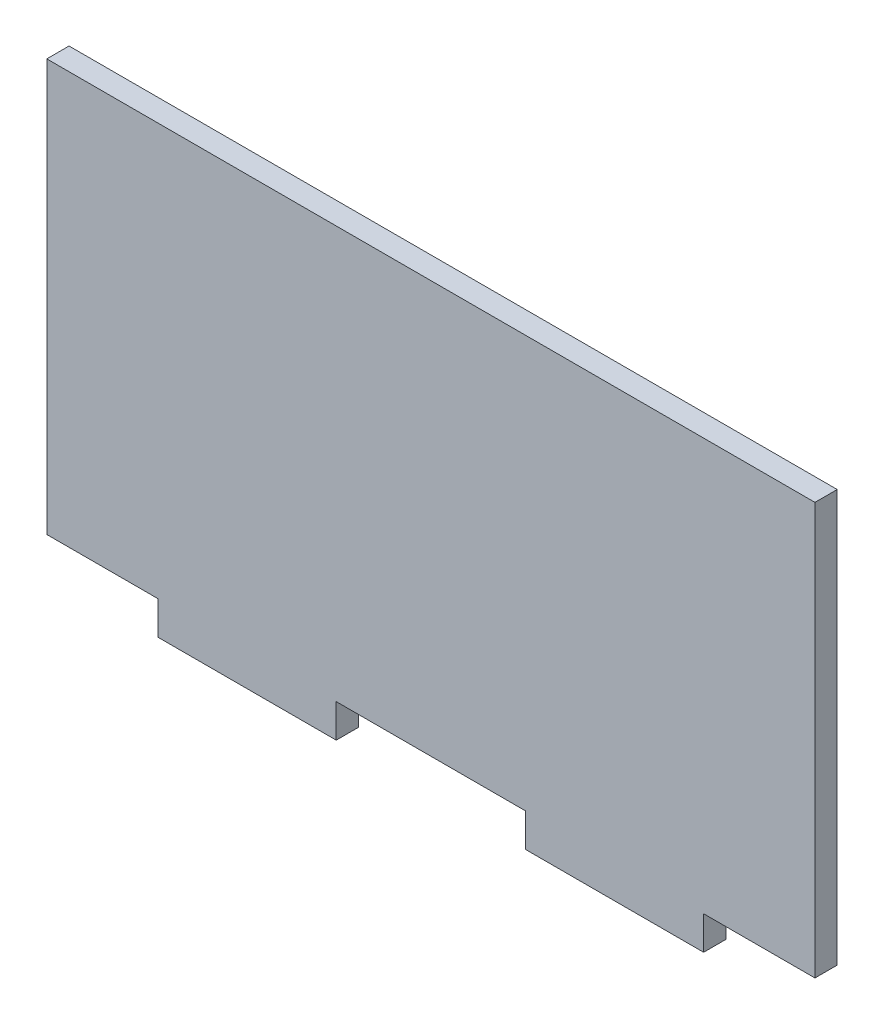
ISO-10303-21;
HEADER;
FILE_DESCRIPTION(('STEP AP214'),'2;1');
FILE_NAME('part.step','',(''),(''),'','','');
FILE_SCHEMA(('AUTOMOTIVE_DESIGN { 1 0 10303 214 1 1 1 1 }'));
ENDSEC;
DATA;
#1=APPLICATION_CONTEXT('core data for automotive mechanical design processes');
#2=APPLICATION_PROTOCOL_DEFINITION('international standard','automotive_design',2000,#1);
#3=PRODUCT_CONTEXT('',#1,'mechanical');
#4=PRODUCT('Part','Part','',(#3));
#5=PRODUCT_RELATED_PRODUCT_CATEGORY('part','',(#4));
#6=PRODUCT_DEFINITION_FORMATION('','',#4);
#7=PRODUCT_DEFINITION_CONTEXT('part definition',#1,'design');
#8=PRODUCT_DEFINITION('design','',#6,#7);
#9=PRODUCT_DEFINITION_SHAPE('','',#8);
#10=(LENGTH_UNIT() NAMED_UNIT(*) SI_UNIT(.MILLI.,.METRE.));
#11=(NAMED_UNIT(*) PLANE_ANGLE_UNIT() SI_UNIT($,.RADIAN.));
#12=(NAMED_UNIT(*) SI_UNIT($,.STERADIAN.) SOLID_ANGLE_UNIT());
#13=UNCERTAINTY_MEASURE_WITH_UNIT(LENGTH_MEASURE(1.E-05),#10,'distance_accuracy_value','');
#14=(GEOMETRIC_REPRESENTATION_CONTEXT(3) GLOBAL_UNCERTAINTY_ASSIGNED_CONTEXT((#13)) GLOBAL_UNIT_ASSIGNED_CONTEXT((#10,
#11,#12)) REPRESENTATION_CONTEXT('',''));
#15=CARTESIAN_POINT('',(0.,0.,0.));
#16=DIRECTION('',(0.,0.,1.));
#17=DIRECTION('',(1.,0.,0.));
#18=AXIS2_PLACEMENT_3D('',#15,#16,#17);
#19=CARTESIAN_POINT('',(0.,-17.,2.));
#20=DIRECTION('',(0.,-1.,0.));
#21=DIRECTION('',(1.,0.,0.));
#22=AXIS2_PLACEMENT_3D('',#19,#20,#21);
#23=PLANE('',#22);
#24=DIRECTION('',(-1.,0.,0.));
#25=VECTOR('',#24,1.);
#26=CARTESIAN_POINT('',(0.,-17.,0.));
#27=LINE('',#26,#25);
#28=CARTESIAN_POINT('',(34.5,-17.,0.));
#29=VERTEX_POINT('',#28);
#30=CARTESIAN_POINT('',(24.5,-17.,0.));
#31=VERTEX_POINT('',#30);
#32=EDGE_CURVE('E169',#29,#31,#27,.T.);
#33=ORIENTED_EDGE('',*,*,#32,.F.);
#34=DIRECTION('',(0.,0.,-1.));
#35=VECTOR('',#34,1.);
#36=CARTESIAN_POINT('',(34.5,-17.,2.));
#37=LINE('',#36,#35);
#38=CARTESIAN_POINT('',(34.5,-17.,2.));
#39=VERTEX_POINT('',#38);
#40=EDGE_CURVE('E11',#39,#29,#37,.T.);
#41=ORIENTED_EDGE('',*,*,#40,.F.);
#42=DIRECTION('',(-1.,0.,0.));
#43=VECTOR('',#42,1.);
#44=CARTESIAN_POINT('',(0.,-17.,2.));
#45=LINE('',#44,#43);
#46=CARTESIAN_POINT('',(24.5,-17.,2.));
#47=VERTEX_POINT('',#46);
#48=EDGE_CURVE('E163',#39,#47,#45,.T.);
#49=ORIENTED_EDGE('',*,*,#48,.T.);
#50=DIRECTION('',(0.,0.,-1.));
#51=VECTOR('',#50,1.);
#52=CARTESIAN_POINT('',(24.5,-17.,2.));
#53=LINE('',#52,#51);
#54=EDGE_CURVE('E105',#47,#31,#53,.T.);
#55=ORIENTED_EDGE('',*,*,#54,.T.);
#56=EDGE_LOOP('',(#33,#41,#49,#55));
#57=FACE_BOUND('',#56,.T.);
#58=ADVANCED_FACE('F41',(#57),#23,.T.);
#59=CARTESIAN_POINT('',(34.5,0.,2.));
#60=DIRECTION('',(-1.,0.,0.));
#61=DIRECTION('',(0.,0.,1.));
#62=AXIS2_PLACEMENT_3D('',#59,#60,#61);
#63=PLANE('',#62);
#64=DIRECTION('',(0.,1.,0.));
#65=VECTOR('',#64,1.);
#66=CARTESIAN_POINT('',(34.5,0.,0.));
#67=LINE('',#66,#65);
#68=CARTESIAN_POINT('',(34.5,20.,0.));
#69=VERTEX_POINT('',#68);
#70=EDGE_CURVE('E173',#29,#69,#67,.T.);
#71=ORIENTED_EDGE('',*,*,#70,.T.);
#72=DIRECTION('',(0.,0.,-1.));
#73=VECTOR('',#72,1.);
#74=CARTESIAN_POINT('',(34.5,20.,2.));
#75=LINE('',#74,#73);
#76=CARTESIAN_POINT('',(34.5,20.,2.));
#77=VERTEX_POINT('',#76);
#78=EDGE_CURVE('E51',#77,#69,#75,.T.);
#79=ORIENTED_EDGE('',*,*,#78,.F.);
#80=DIRECTION('',(0.,1.,0.));
#81=VECTOR('',#80,1.);
#82=CARTESIAN_POINT('',(34.5,0.,2.));
#83=LINE('',#82,#81);
#84=EDGE_CURVE('E251',#39,#77,#83,.T.);
#85=ORIENTED_EDGE('',*,*,#84,.F.);
#86=ORIENTED_EDGE('',*,*,#40,.T.);
#87=EDGE_LOOP('',(#71,#79,#85,#86));
#88=FACE_BOUND('',#87,.T.);
#89=ADVANCED_FACE('F43',(#88),#63,.F.);
#90=CARTESIAN_POINT('',(0.,20.,2.));
#91=DIRECTION('',(0.,1.,0.));
#92=DIRECTION('',(0.,0.,1.));
#93=AXIS2_PLACEMENT_3D('',#90,#91,#92);
#94=PLANE('',#93);
#95=DIRECTION('',(1.,0.,0.));
#96=VECTOR('',#95,1.);
#97=CARTESIAN_POINT('',(0.,20.,0.));
#98=LINE('',#97,#96);
#99=CARTESIAN_POINT('',(-34.5,20.,0.));
#100=VERTEX_POINT('',#99);
#101=EDGE_CURVE('E179',#100,#69,#98,.T.);
#102=ORIENTED_EDGE('',*,*,#101,.F.);
#103=DIRECTION('',(0.,0.,-1.));
#104=VECTOR('',#103,1.);
#105=CARTESIAN_POINT('',(-34.5,20.,2.));
#106=LINE('',#105,#104);
#107=CARTESIAN_POINT('',(-34.5,20.,2.));
#108=VERTEX_POINT('',#107);
#109=EDGE_CURVE('E227',#108,#100,#106,.T.);
#110=ORIENTED_EDGE('',*,*,#109,.F.);
#111=DIRECTION('',(1.,0.,0.));
#112=VECTOR('',#111,1.);
#113=CARTESIAN_POINT('',(0.,20.,2.));
#114=LINE('',#113,#112);
#115=EDGE_CURVE('E236',#108,#77,#114,.T.);
#116=ORIENTED_EDGE('',*,*,#115,.T.);
#117=ORIENTED_EDGE('',*,*,#78,.T.);
#118=EDGE_LOOP('',(#102,#110,#116,#117));
#119=FACE_BOUND('',#118,.T.);
#120=ADVANCED_FACE('F234',(#119),#94,.T.);
#121=CARTESIAN_POINT('',(-34.5,0.,2.));
#122=DIRECTION('',(-1.,0.,0.));
#123=DIRECTION('',(0.,0.,1.));
#124=AXIS2_PLACEMENT_3D('',#121,#122,#123);
#125=PLANE('',#124);
#126=DIRECTION('',(0.,1.,0.));
#127=VECTOR('',#126,1.);
#128=CARTESIAN_POINT('',(-34.5,0.,0.));
#129=LINE('',#128,#127);
#130=CARTESIAN_POINT('',(-34.5,-17.,0.));
#131=VERTEX_POINT('',#130);
#132=EDGE_CURVE('E183',#131,#100,#129,.T.);
#133=ORIENTED_EDGE('',*,*,#132,.F.);
#134=DIRECTION('',(0.,0.,-1.));
#135=VECTOR('',#134,1.);
#136=CARTESIAN_POINT('',(-34.5,-17.,2.));
#137=LINE('',#136,#135);
#138=CARTESIAN_POINT('',(-34.5,-17.,2.));
#139=VERTEX_POINT('',#138);
#140=EDGE_CURVE('E224',#139,#131,#137,.T.);
#141=ORIENTED_EDGE('',*,*,#140,.F.);
#142=DIRECTION('',(0.,1.,0.));
#143=VECTOR('',#142,1.);
#144=CARTESIAN_POINT('',(-34.5,0.,2.));
#145=LINE('',#144,#143);
#146=EDGE_CURVE('E248',#139,#108,#145,.T.);
#147=ORIENTED_EDGE('',*,*,#146,.T.);
#148=ORIENTED_EDGE('',*,*,#109,.T.);
#149=EDGE_LOOP('',(#133,#141,#147,#148));
#150=FACE_BOUND('',#149,.T.);
#151=ADVANCED_FACE('F245',(#150),#125,.T.);
#152=CARTESIAN_POINT('',(-24.5,-17.,0.));
#153=VERTEX_POINT('',#152);
#154=EDGE_CURVE('E175',#153,#131,#27,.T.);
#155=ORIENTED_EDGE('',*,*,#154,.F.);
#156=DIRECTION('',(0.,0.,-1.));
#157=VECTOR('',#156,1.);
#158=CARTESIAN_POINT('',(-24.5,-17.,2.));
#159=LINE('',#158,#157);
#160=CARTESIAN_POINT('',(-24.5,-17.,2.));
#161=VERTEX_POINT('',#160);
#162=EDGE_CURVE('E221',#161,#153,#159,.T.);
#163=ORIENTED_EDGE('',*,*,#162,.F.);
#164=EDGE_CURVE('E162',#161,#139,#45,.T.);
#165=ORIENTED_EDGE('',*,*,#164,.T.);
#166=ORIENTED_EDGE('',*,*,#140,.T.);
#167=EDGE_LOOP('',(#155,#163,#165,#166));
#168=FACE_BOUND('',#167,.T.);
#169=ADVANCED_FACE('F284',(#168),#23,.T.);
#170=CARTESIAN_POINT('',(-24.5,0.,2.));
#171=DIRECTION('',(-1.,0.,0.));
#172=DIRECTION('',(0.,0.,1.));
#173=AXIS2_PLACEMENT_3D('',#170,#171,#172);
#174=PLANE('',#173);
#175=DIRECTION('',(0.,1.,0.));
#176=VECTOR('',#175,1.);
#177=CARTESIAN_POINT('',(-24.5,0.,0.));
#178=LINE('',#177,#176);
#179=CARTESIAN_POINT('',(-24.5,-20.,0.));
#180=VERTEX_POINT('',#179);
#181=EDGE_CURVE('E187',#180,#153,#178,.T.);
#182=ORIENTED_EDGE('',*,*,#181,.F.);
#183=DIRECTION('',(0.,0.,-1.));
#184=VECTOR('',#183,1.);
#185=CARTESIAN_POINT('',(-24.5,-20.,2.));
#186=LINE('',#185,#184);
#187=CARTESIAN_POINT('',(-24.5,-20.,2.));
#188=VERTEX_POINT('',#187);
#189=EDGE_CURVE('E218',#188,#180,#186,.T.);
#190=ORIENTED_EDGE('',*,*,#189,.F.);
#191=DIRECTION('',(0.,1.,0.));
#192=VECTOR('',#191,1.);
#193=CARTESIAN_POINT('',(-24.5,0.,2.));
#194=LINE('',#193,#192);
#195=EDGE_CURVE('E259',#188,#161,#194,.T.);
#196=ORIENTED_EDGE('',*,*,#195,.T.);
#197=ORIENTED_EDGE('',*,*,#162,.T.);
#198=EDGE_LOOP('',(#182,#190,#196,#197));
#199=FACE_BOUND('',#198,.T.);
#200=ADVANCED_FACE('F287',(#199),#174,.T.);
#201=CARTESIAN_POINT('',(0.,-20.,2.));
#202=DIRECTION('',(0.,1.,0.));
#203=DIRECTION('',(0.,0.,1.));
#204=AXIS2_PLACEMENT_3D('',#201,#202,#203);
#205=PLANE('',#204);
#206=DIRECTION('',(1.,0.,0.));
#207=VECTOR('',#206,1.);
#208=CARTESIAN_POINT('',(0.,-20.,0.));
#209=LINE('',#208,#207);
#210=CARTESIAN_POINT('',(-8.5,-20.,0.));
#211=VERTEX_POINT('',#210);
#212=EDGE_CURVE('E191',#180,#211,#209,.T.);
#213=ORIENTED_EDGE('',*,*,#212,.T.);
#214=DIRECTION('',(0.,0.,-1.));
#215=VECTOR('',#214,1.);
#216=CARTESIAN_POINT('',(-8.5,-20.,2.));
#217=LINE('',#216,#215);
#218=CARTESIAN_POINT('',(-8.5,-20.,2.));
#219=VERTEX_POINT('',#218);
#220=EDGE_CURVE('E214',#219,#211,#217,.T.);
#221=ORIENTED_EDGE('',*,*,#220,.F.);
#222=DIRECTION('',(1.,0.,0.));
#223=VECTOR('',#222,1.);
#224=CARTESIAN_POINT('',(0.,-20.,2.));
#225=LINE('',#224,#223);
#226=EDGE_CURVE('E262',#188,#219,#225,.T.);
#227=ORIENTED_EDGE('',*,*,#226,.F.);
#228=ORIENTED_EDGE('',*,*,#189,.T.);
#229=EDGE_LOOP('',(#213,#221,#227,#228));
#230=FACE_BOUND('',#229,.T.);
#231=ADVANCED_FACE('F290',(#230),#205,.F.);
#232=CARTESIAN_POINT('',(-8.5,0.,2.));
#233=DIRECTION('',(-1.,0.,0.));
#234=DIRECTION('',(0.,0.,1.));
#235=AXIS2_PLACEMENT_3D('',#232,#233,#234);
#236=PLANE('',#235);
#237=DIRECTION('',(0.,1.,0.));
#238=VECTOR('',#237,1.);
#239=CARTESIAN_POINT('',(-8.5,0.,0.));
#240=LINE('',#239,#238);
#241=CARTESIAN_POINT('',(-8.5,-17.,0.));
#242=VERTEX_POINT('',#241);
#243=EDGE_CURVE('E194',#211,#242,#240,.T.);
#244=ORIENTED_EDGE('',*,*,#243,.T.);
#245=DIRECTION('',(0.,0.,-1.));
#246=VECTOR('',#245,1.);
#247=CARTESIAN_POINT('',(-8.5,-17.,2.));
#248=LINE('',#247,#246);
#249=CARTESIAN_POINT('',(-8.5,-17.,2.));
#250=VERTEX_POINT('',#249);
#251=EDGE_CURVE('E211',#250,#242,#248,.T.);
#252=ORIENTED_EDGE('',*,*,#251,.F.);
#253=DIRECTION('',(0.,1.,0.));
#254=VECTOR('',#253,1.);
#255=CARTESIAN_POINT('',(-8.5,0.,2.));
#256=LINE('',#255,#254);
#257=EDGE_CURVE('E160',#219,#250,#256,.T.);
#258=ORIENTED_EDGE('',*,*,#257,.F.);
#259=ORIENTED_EDGE('',*,*,#220,.T.);
#260=EDGE_LOOP('',(#244,#252,#258,#259));
#261=FACE_BOUND('',#260,.T.);
#262=ADVANCED_FACE('F271',(#261),#236,.F.);
#263=CARTESIAN_POINT('',(8.50000000000002,-17.,0.));
#264=VERTEX_POINT('',#263);
#265=EDGE_CURVE('E174',#264,#242,#27,.T.);
#266=ORIENTED_EDGE('',*,*,#265,.F.);
#267=DIRECTION('',(0.,0.,-1.));
#268=VECTOR('',#267,1.);
#269=CARTESIAN_POINT('',(8.50000000000002,-17.,2.));
#270=LINE('',#269,#268);
#271=CARTESIAN_POINT('',(8.50000000000002,-17.,2.));
#272=VERTEX_POINT('',#271);
#273=EDGE_CURVE('E146',#272,#264,#270,.T.);
#274=ORIENTED_EDGE('',*,*,#273,.F.);
#275=EDGE_CURVE('E156',#272,#250,#45,.T.);
#276=ORIENTED_EDGE('',*,*,#275,.T.);
#277=ORIENTED_EDGE('',*,*,#251,.T.);
#278=EDGE_LOOP('',(#266,#274,#276,#277));
#279=FACE_BOUND('',#278,.T.);
#280=ADVANCED_FACE('F276',(#279),#23,.T.);
#281=CARTESIAN_POINT('',(8.50000000000002,0.,2.));
#282=DIRECTION('',(-1.,0.,0.));
#283=DIRECTION('',(0.,0.,1.));
#284=AXIS2_PLACEMENT_3D('',#281,#282,#283);
#285=PLANE('',#284);
#286=DIRECTION('',(0.,1.,0.));
#287=VECTOR('',#286,1.);
#288=CARTESIAN_POINT('',(8.50000000000002,0.,0.));
#289=LINE('',#288,#287);
#290=CARTESIAN_POINT('',(8.50000000000002,-20.,0.));
#291=VERTEX_POINT('',#290);
#292=EDGE_CURVE('E144',#291,#264,#289,.T.);
#293=ORIENTED_EDGE('',*,*,#292,.F.);
#294=DIRECTION('',(0.,0.,-1.));
#295=VECTOR('',#294,1.);
#296=CARTESIAN_POINT('',(8.50000000000002,-20.,2.));
#297=LINE('',#296,#295);
#298=CARTESIAN_POINT('',(8.50000000000002,-20.,2.));
#299=VERTEX_POINT('',#298);
#300=EDGE_CURVE('E138',#299,#291,#297,.T.);
#301=ORIENTED_EDGE('',*,*,#300,.F.);
#302=DIRECTION('',(0.,1.,0.));
#303=VECTOR('',#302,1.);
#304=CARTESIAN_POINT('',(8.50000000000002,0.,2.));
#305=LINE('',#304,#303);
#306=EDGE_CURVE('E142',#299,#272,#305,.T.);
#307=ORIENTED_EDGE('',*,*,#306,.T.);
#308=ORIENTED_EDGE('',*,*,#273,.T.);
#309=EDGE_LOOP('',(#293,#301,#307,#308));
#310=FACE_BOUND('',#309,.T.);
#311=ADVANCED_FACE('F140',(#310),#285,.T.);
#312=CARTESIAN_POINT('',(0.,-20.,2.));
#313=DIRECTION('',(0.,1.,0.));
#314=DIRECTION('',(0.,0.,1.));
#315=AXIS2_PLACEMENT_3D('',#312,#313,#314);
#316=PLANE('',#315);
#317=DIRECTION('',(1.,0.,0.));
#318=VECTOR('',#317,1.);
#319=CARTESIAN_POINT('',(0.,-20.,0.));
#320=LINE('',#319,#318);
#321=CARTESIAN_POINT('',(24.5,-20.,0.));
#322=VERTEX_POINT('',#321);
#323=EDGE_CURVE('E98',#291,#322,#320,.T.);
#324=ORIENTED_EDGE('',*,*,#323,.T.);
#325=DIRECTION('',(0.,0.,-1.));
#326=VECTOR('',#325,1.);
#327=CARTESIAN_POINT('',(24.5,-20.,2.));
#328=LINE('',#327,#326);
#329=CARTESIAN_POINT('',(24.5,-20.,2.));
#330=VERTEX_POINT('',#329);
#331=EDGE_CURVE('E147',#330,#322,#328,.T.);
#332=ORIENTED_EDGE('',*,*,#331,.F.);
#333=DIRECTION('',(1.,0.,0.));
#334=VECTOR('',#333,1.);
#335=CARTESIAN_POINT('',(0.,-20.,2.));
#336=LINE('',#335,#334);
#337=EDGE_CURVE('E149',#299,#330,#336,.T.);
#338=ORIENTED_EDGE('',*,*,#337,.F.);
#339=ORIENTED_EDGE('',*,*,#300,.T.);
#340=EDGE_LOOP('',(#324,#332,#338,#339));
#341=FACE_BOUND('',#340,.T.);
#342=ADVANCED_FACE('F150',(#341),#316,.F.);
#343=CARTESIAN_POINT('',(24.5,0.,2.));
#344=DIRECTION('',(-1.,0.,0.));
#345=DIRECTION('',(0.,0.,1.));
#346=AXIS2_PLACEMENT_3D('',#343,#344,#345);
#347=PLANE('',#346);
#348=DIRECTION('',(0.,1.,0.));
#349=VECTOR('',#348,1.);
#350=CARTESIAN_POINT('',(24.5,0.,0.));
#351=LINE('',#350,#349);
#352=EDGE_CURVE('E202',#322,#31,#351,.T.);
#353=ORIENTED_EDGE('',*,*,#352,.T.);
#354=ORIENTED_EDGE('',*,*,#54,.F.);
#355=DIRECTION('',(0.,1.,0.));
#356=VECTOR('',#355,1.);
#357=CARTESIAN_POINT('',(24.5,0.,2.));
#358=LINE('',#357,#356);
#359=EDGE_CURVE('E59',#330,#47,#358,.T.);
#360=ORIENTED_EDGE('',*,*,#359,.F.);
#361=ORIENTED_EDGE('',*,*,#331,.T.);
#362=EDGE_LOOP('',(#353,#354,#360,#361));
#363=FACE_BOUND('',#362,.T.);
#364=ADVANCED_FACE('F280',(#363),#347,.F.);
#365=CARTESIAN_POINT('',(0.,0.,2.));
#366=DIRECTION('',(0.,0.,1.));
#367=DIRECTION('',(1.,0.,0.));
#368=AXIS2_PLACEMENT_3D('',#365,#366,#367);
#369=PLANE('',#368);
#370=ORIENTED_EDGE('',*,*,#48,.F.);
#371=ORIENTED_EDGE('',*,*,#84,.T.);
#372=ORIENTED_EDGE('',*,*,#115,.F.);
#373=ORIENTED_EDGE('',*,*,#146,.F.);
#374=ORIENTED_EDGE('',*,*,#164,.F.);
#375=ORIENTED_EDGE('',*,*,#195,.F.);
#376=ORIENTED_EDGE('',*,*,#226,.T.);
#377=ORIENTED_EDGE('',*,*,#257,.T.);
#378=ORIENTED_EDGE('',*,*,#275,.F.);
#379=ORIENTED_EDGE('',*,*,#306,.F.);
#380=ORIENTED_EDGE('',*,*,#337,.T.);
#381=ORIENTED_EDGE('',*,*,#359,.T.);
#382=EDGE_LOOP('',(#370,#371,#372,#373,#374,#375,#376,#377,#378,#379,#380,#381));
#383=FACE_BOUND('',#382,.T.);
#384=ADVANCED_FACE('F154',(#383),#369,.T.);
#385=CARTESIAN_POINT('',(0.,0.,0.));
#386=DIRECTION('',(0.,0.,1.));
#387=DIRECTION('',(1.,0.,0.));
#388=AXIS2_PLACEMENT_3D('',#385,#386,#387);
#389=PLANE('',#388);
#390=ORIENTED_EDGE('',*,*,#32,.T.);
#391=ORIENTED_EDGE('',*,*,#352,.F.);
#392=ORIENTED_EDGE('',*,*,#323,.F.);
#393=ORIENTED_EDGE('',*,*,#292,.T.);
#394=ORIENTED_EDGE('',*,*,#265,.T.);
#395=ORIENTED_EDGE('',*,*,#243,.F.);
#396=ORIENTED_EDGE('',*,*,#212,.F.);
#397=ORIENTED_EDGE('',*,*,#181,.T.);
#398=ORIENTED_EDGE('',*,*,#154,.T.);
#399=ORIENTED_EDGE('',*,*,#132,.T.);
#400=ORIENTED_EDGE('',*,*,#101,.T.);
#401=ORIENTED_EDGE('',*,*,#70,.F.);
#402=EDGE_LOOP('',(#390,#391,#392,#393,#394,#395,#396,#397,#398,#399,#400,#401));
#403=FACE_BOUND('',#402,.T.);
#404=ADVANCED_FACE('F240',(#403),#389,.F.);
#405=CLOSED_SHELL('',(#58,#89,#120,#151,#169,#200,#231,#262,#280,#311,#342,#364,#384,#404));
#406=MANIFOLD_SOLID_BREP('B2',#405);
#407=ADVANCED_BREP_SHAPE_REPRESENTATION('',(#18,#406),#14);
#408=SHAPE_DEFINITION_REPRESENTATION(#9,#407);
ENDSEC;
END-ISO-10303-21;
